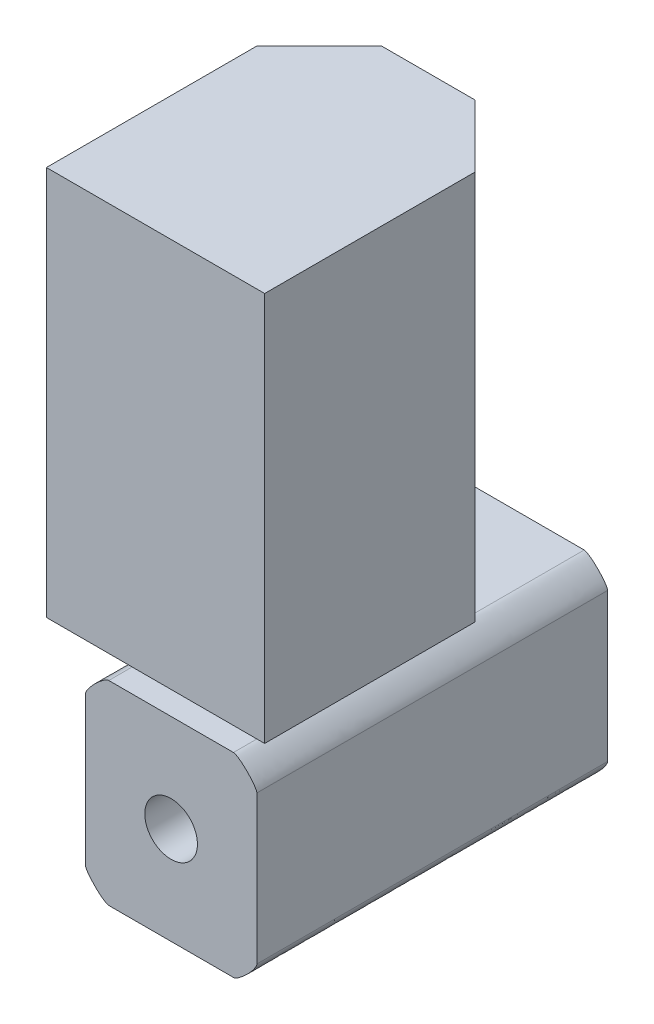
ISO-10303-21;
HEADER;
FILE_DESCRIPTION(('STEP AP214'),'2;1');
FILE_NAME('part.step','',(''),(''),'','','');
FILE_SCHEMA(('AUTOMOTIVE_DESIGN { 1 0 10303 214 1 1 1 1 }'));
ENDSEC;
DATA;
#1=APPLICATION_CONTEXT('core data for automotive mechanical design processes');
#2=APPLICATION_PROTOCOL_DEFINITION('international standard','automotive_design',2000,#1);
#3=PRODUCT_CONTEXT('',#1,'mechanical');
#4=PRODUCT('Part','Part','',(#3));
#5=PRODUCT_RELATED_PRODUCT_CATEGORY('part','',(#4));
#6=PRODUCT_DEFINITION_FORMATION('','',#4);
#7=PRODUCT_DEFINITION_CONTEXT('part definition',#1,'design');
#8=PRODUCT_DEFINITION('design','',#6,#7);
#9=PRODUCT_DEFINITION_SHAPE('','',#8);
#10=(LENGTH_UNIT() NAMED_UNIT(*) SI_UNIT(.MILLI.,.METRE.));
#11=(NAMED_UNIT(*) PLANE_ANGLE_UNIT() SI_UNIT($,.RADIAN.));
#12=(NAMED_UNIT(*) SI_UNIT($,.STERADIAN.) SOLID_ANGLE_UNIT());
#13=UNCERTAINTY_MEASURE_WITH_UNIT(LENGTH_MEASURE(1.E-05),#10,'distance_accuracy_value','');
#14=(GEOMETRIC_REPRESENTATION_CONTEXT(3) GLOBAL_UNCERTAINTY_ASSIGNED_CONTEXT((#13)) GLOBAL_UNIT_ASSIGNED_CONTEXT((#10,
#11,#12)) REPRESENTATION_CONTEXT('',''));
#15=CARTESIAN_POINT('',(0.,0.,0.));
#16=DIRECTION('',(0.,0.,1.));
#17=DIRECTION('',(1.,0.,0.));
#18=AXIS2_PLACEMENT_3D('',#15,#16,#17);
#19=CARTESIAN_POINT('',(-88.8214874697385,29.1570616468552,45.));
#20=DIRECTION('',(0.,1.,0.));
#21=DIRECTION('',(0.,0.,1.));
#22=AXIS2_PLACEMENT_3D('',#19,#20,#21);
#23=PLANE('',#22);
#24=DIRECTION('',(-0.866025403784439,0.,0.5));
#25=VECTOR('',#24,1.);
#26=CARTESIAN_POINT('',(-77.8214874697385,29.1570616468552,13.8397459621556));
#27=LINE('',#26,#25);
#28=CARTESIAN_POINT('',(-77.8214874697385,29.1570616468552,13.8397459621556));
#29=VERTEX_POINT('',#28);
#30=CARTESIAN_POINT('',(-85.3214874697385,29.1570616468552,18.1698729810778));
#31=VERTEX_POINT('',#30);
#32=EDGE_CURVE('E206',#29,#31,#27,.T.);
#33=ORIENTED_EDGE('',*,*,#32,.F.);
#34=DIRECTION('',(-0.866025403784439,0.,-0.5));
#35=VECTOR('',#34,1.);
#36=CARTESIAN_POINT('',(-70.3214874697385,29.1570616468552,18.1698729810778));
#37=LINE('',#36,#35);
#38=CARTESIAN_POINT('',(-70.3214874697385,29.1570616468552,18.1698729810778));
#39=VERTEX_POINT('',#38);
#40=EDGE_CURVE('E276',#39,#29,#37,.T.);
#41=ORIENTED_EDGE('',*,*,#40,.F.);
#42=DIRECTION('',(0.,0.,-1.));
#43=VECTOR('',#42,1.);
#44=CARTESIAN_POINT('',(-70.3214874697385,29.1570616468552,26.8301270189222));
#45=LINE('',#44,#43);
#46=CARTESIAN_POINT('',(-70.3214874697385,29.1570616468552,26.8301270189222));
#47=VERTEX_POINT('',#46);
#48=EDGE_CURVE('E312',#47,#39,#45,.T.);
#49=ORIENTED_EDGE('',*,*,#48,.F.);
#50=DIRECTION('',(0.866025403784438,0.,-0.5));
#51=VECTOR('',#50,1.);
#52=CARTESIAN_POINT('',(-77.8214874697385,29.1570616468552,31.1602540378444));
#53=LINE('',#52,#51);
#54=CARTESIAN_POINT('',(-77.8214874697385,29.1570616468552,31.1602540378444));
#55=VERTEX_POINT('',#54);
#56=EDGE_CURVE('E308',#55,#47,#53,.T.);
#57=ORIENTED_EDGE('',*,*,#56,.F.);
#58=DIRECTION('',(0.866025403784439,0.,0.5));
#59=VECTOR('',#58,1.);
#60=CARTESIAN_POINT('',(-85.3214874697385,29.1570616468552,26.8301270189222));
#61=LINE('',#60,#59);
#62=CARTESIAN_POINT('',(-85.3214874697385,29.1570616468552,26.8301270189222));
#63=VERTEX_POINT('',#62);
#64=EDGE_CURVE('E304',#63,#55,#61,.T.);
#65=ORIENTED_EDGE('',*,*,#64,.F.);
#66=DIRECTION('',(0.,0.,1.));
#67=VECTOR('',#66,1.);
#68=CARTESIAN_POINT('',(-85.3214874697385,29.1570616468552,18.1698729810778));
#69=LINE('',#68,#67);
#70=EDGE_CURVE('E300',#31,#63,#69,.T.);
#71=ORIENTED_EDGE('',*,*,#70,.F.);
#72=EDGE_LOOP('',(#33,#41,#49,#57,#65,#71));
#73=FACE_BOUND('',#72,.T.);
#74=DIRECTION('',(1.,0.,0.));
#75=VECTOR('',#74,1.);
#76=CARTESIAN_POINT('',(-88.8214874697385,29.1570616468552,0.));
#77=LINE('',#76,#75);
#78=CARTESIAN_POINT('',(-85.8214874697385,29.1570616468552,0.));
#79=VERTEX_POINT('',#78);
#80=CARTESIAN_POINT('',(-69.8214874697385,29.1570616468552,0.));
#81=VERTEX_POINT('',#80);
#82=EDGE_CURVE('E342',#79,#81,#77,.T.);
#83=ORIENTED_EDGE('',*,*,#82,.F.);
#84=CARTESIAN_POINT('',(-85.8214874697385,29.1570616468552,47.25));
#85=CARTESIAN_POINT('',(-85.8214874697385,29.1570616468552,30.75));
#86=CARTESIAN_POINT('',(-85.8214874697385,29.1570616468552,14.25));
#87=CARTESIAN_POINT('',(-85.8214874697385,29.1570616468552,-2.25));
#88=(BOUNDED_CURVE() B_SPLINE_CURVE(3,(#84,#85,#86,#87),.UNSPECIFIED.,.F.,
.F.) B_SPLINE_CURVE_WITH_KNOTS((4,4),(-0.04725,0.00225),
.UNSPECIFIED.) CURVE() GEOMETRIC_REPRESENTATION_ITEM() RATIONAL_B_SPLINE_CURVE((1.,1.,1.,1.)) REPRESENTATION_ITEM(''));
#89=CARTESIAN_POINT('',(-85.8214874697385,29.1570616468552,45.));
#90=VERTEX_POINT('',#89);
#91=EDGE_CURVE('E564',#79,#90,#88,.F.);
#92=ORIENTED_EDGE('',*,*,#91,.T.);
#93=DIRECTION('',(1.,0.,0.));
#94=VECTOR('',#93,1.);
#95=CARTESIAN_POINT('',(-88.8214874697385,29.1570616468552,45.));
#96=LINE('',#95,#94);
#97=CARTESIAN_POINT('',(-69.8214874697385,29.1570616468552,45.));
#98=VERTEX_POINT('',#97);
#99=EDGE_CURVE('E348',#90,#98,#96,.T.);
#100=ORIENTED_EDGE('',*,*,#99,.T.);
#101=CARTESIAN_POINT('',(-69.8214874697385,29.1570616468552,-2.25));
#102=CARTESIAN_POINT('',(-69.8214874697385,29.1570616468552,14.25));
#103=CARTESIAN_POINT('',(-69.8214874697385,29.1570616468552,30.75));
#104=CARTESIAN_POINT('',(-69.8214874697385,29.1570616468552,47.25));
#105=(BOUNDED_CURVE() B_SPLINE_CURVE(3,(#101,#102,#103,#104),.UNSPECIFIED.,.F.,
.F.) B_SPLINE_CURVE_WITH_KNOTS((4,4),(-0.00225,0.04725),
.UNSPECIFIED.) CURVE() GEOMETRIC_REPRESENTATION_ITEM() RATIONAL_B_SPLINE_CURVE((1.,1.,1.,1.)) REPRESENTATION_ITEM(''));
#106=EDGE_CURVE('E416',#98,#81,#105,.F.);
#107=ORIENTED_EDGE('',*,*,#106,.T.);
#108=EDGE_LOOP('',(#83,#92,#100,#107));
#109=FACE_BOUND('',#108,.T.);
#110=ADVANCED_FACE('F48',(#73,#109),#23,.T.);
#111=CARTESIAN_POINT('',(-88.8214874697385,29.1570616468552,45.));
#112=DIRECTION('',(1.,0.,0.));
#113=DIRECTION('',(0.,0.,-1.));
#114=AXIS2_PLACEMENT_3D('',#111,#112,#113);
#115=PLANE('',#114);
#116=DIRECTION('',(0.,-1.,0.));
#117=VECTOR('',#116,1.);
#118=CARTESIAN_POINT('',(-88.8214874697385,29.1570616468552,0.));
#119=LINE('',#118,#117);
#120=CARTESIAN_POINT('',(-88.8214874697385,26.1570616468552,0.));
#121=VERTEX_POINT('',#120);
#122=CARTESIAN_POINT('',(-88.8214874697385,7.15706164685515,0.));
#123=VERTEX_POINT('',#122);
#124=EDGE_CURVE('E354',#121,#123,#119,.T.);
#125=ORIENTED_EDGE('',*,*,#124,.T.);
#126=CARTESIAN_POINT('',(-88.8214874697385,7.15706164685515,47.25));
#127=CARTESIAN_POINT('',(-88.8214874697385,7.15706164685515,30.75));
#128=CARTESIAN_POINT('',(-88.8214874697385,7.15706164685515,14.25));
#129=CARTESIAN_POINT('',(-88.8214874697385,7.15706164685515,-2.25));
#130=(BOUNDED_CURVE() B_SPLINE_CURVE(3,(#126,#127,#128,#129),.UNSPECIFIED.,.F.,
.F.) B_SPLINE_CURVE_WITH_KNOTS((4,4),(-0.00225,0.04725),
.UNSPECIFIED.) CURVE() GEOMETRIC_REPRESENTATION_ITEM() RATIONAL_B_SPLINE_CURVE((1.,1.,1.,1.)) REPRESENTATION_ITEM(''));
#131=CARTESIAN_POINT('',(-88.8214874697385,7.15706164685515,45.));
#132=VERTEX_POINT('',#131);
#133=EDGE_CURVE('E505',#123,#132,#130,.F.);
#134=ORIENTED_EDGE('',*,*,#133,.T.);
#135=DIRECTION('',(0.,-1.,0.));
#136=VECTOR('',#135,1.);
#137=CARTESIAN_POINT('',(-88.8214874697385,29.1570616468552,45.));
#138=LINE('',#137,#136);
#139=CARTESIAN_POINT('',(-88.8214874697385,26.1570616468552,45.));
#140=VERTEX_POINT('',#139);
#141=EDGE_CURVE('E647',#140,#132,#138,.T.);
#142=ORIENTED_EDGE('',*,*,#141,.F.);
#143=CARTESIAN_POINT('',(-88.8214874697385,26.1570616468552,-2.25));
#144=CARTESIAN_POINT('',(-88.8214874697385,26.1570616468552,14.25));
#145=CARTESIAN_POINT('',(-88.8214874697385,26.1570616468552,30.75));
#146=CARTESIAN_POINT('',(-88.8214874697385,26.1570616468552,47.25));
#147=(BOUNDED_CURVE() B_SPLINE_CURVE(3,(#143,#144,#145,#146),.UNSPECIFIED.,.F.,
.F.) B_SPLINE_CURVE_WITH_KNOTS((4,4),(-0.04725,0.00225),
.UNSPECIFIED.) CURVE() GEOMETRIC_REPRESENTATION_ITEM() RATIONAL_B_SPLINE_CURVE((1.,1.,1.,1.)) REPRESENTATION_ITEM(''));
#148=EDGE_CURVE('E713',#140,#121,#147,.F.);
#149=ORIENTED_EDGE('',*,*,#148,.T.);
#150=EDGE_LOOP('',(#125,#134,#142,#149));
#151=FACE_BOUND('',#150,.T.);
#152=ADVANCED_FACE('F432',(#151),#115,.F.);
#153=CARTESIAN_POINT('',(-88.8214874697385,4.15706164685515,45.));
#154=DIRECTION('',(0.,1.,0.));
#155=DIRECTION('',(-1.,0.,0.));
#156=AXIS2_PLACEMENT_3D('',#153,#154,#155);
#157=PLANE('',#156);
#158=DIRECTION('',(1.,0.,0.));
#159=VECTOR('',#158,1.);
#160=CARTESIAN_POINT('',(-88.8214874697385,4.15706164685515,45.));
#161=LINE('',#160,#159);
#162=CARTESIAN_POINT('',(-85.8214874697385,4.15706164685515,45.));
#163=VERTEX_POINT('',#162);
#164=CARTESIAN_POINT('',(-69.8214874697385,4.15706164685515,45.));
#165=VERTEX_POINT('',#164);
#166=EDGE_CURVE('E360',#163,#165,#161,.T.);
#167=ORIENTED_EDGE('',*,*,#166,.F.);
#168=CARTESIAN_POINT('',(-85.8214874697385,4.15706164685515,-2.25));
#169=CARTESIAN_POINT('',(-85.8214874697385,4.15706164685515,14.25));
#170=CARTESIAN_POINT('',(-85.8214874697385,4.15706164685515,30.75));
#171=CARTESIAN_POINT('',(-85.8214874697385,4.15706164685515,47.25));
#172=(BOUNDED_CURVE() B_SPLINE_CURVE(3,(#168,#169,#170,#171),.UNSPECIFIED.,.F.,
.F.) B_SPLINE_CURVE_WITH_KNOTS((4,4),(-0.00225,0.04725),
.UNSPECIFIED.) CURVE() GEOMETRIC_REPRESENTATION_ITEM() RATIONAL_B_SPLINE_CURVE((1.,1.,1.,1.)) REPRESENTATION_ITEM(''));
#173=CARTESIAN_POINT('',(-85.8214874697385,4.15706164685515,0.));
#174=VERTEX_POINT('',#173);
#175=EDGE_CURVE('E486',#163,#174,#172,.F.);
#176=ORIENTED_EDGE('',*,*,#175,.T.);
#177=DIRECTION('',(1.,0.,0.));
#178=VECTOR('',#177,1.);
#179=CARTESIAN_POINT('',(-88.8214874697385,4.15706164685515,0.));
#180=LINE('',#179,#178);
#181=CARTESIAN_POINT('',(-69.8214874697385,4.15706164685515,0.));
#182=VERTEX_POINT('',#181);
#183=EDGE_CURVE('E678',#174,#182,#180,.T.);
#184=ORIENTED_EDGE('',*,*,#183,.T.);
#185=CARTESIAN_POINT('',(-69.8214874697385,4.15706164685515,47.25));
#186=CARTESIAN_POINT('',(-69.8214874697385,4.15706164685515,30.75));
#187=CARTESIAN_POINT('',(-69.8214874697385,4.15706164685515,14.25));
#188=CARTESIAN_POINT('',(-69.8214874697385,4.15706164685515,-2.25));
#189=(BOUNDED_CURVE() B_SPLINE_CURVE(3,(#185,#186,#187,#188),.UNSPECIFIED.,.F.,
.F.) B_SPLINE_CURVE_WITH_KNOTS((4,4),(-0.04725,0.00225),
.UNSPECIFIED.) CURVE() GEOMETRIC_REPRESENTATION_ITEM() RATIONAL_B_SPLINE_CURVE((1.,1.,1.,1.)) REPRESENTATION_ITEM(''));
#190=EDGE_CURVE('E642',#182,#165,#189,.F.);
#191=ORIENTED_EDGE('',*,*,#190,.T.);
#192=EDGE_LOOP('',(#167,#176,#184,#191));
#193=FACE_BOUND('',#192,.T.);
#194=ADVANCED_FACE('F691',(#193),#157,.F.);
#195=CARTESIAN_POINT('',(-66.8214874697385,29.1570616468552,45.));
#196=DIRECTION('',(1.,0.,0.));
#197=DIRECTION('',(0.,0.,-1.));
#198=AXIS2_PLACEMENT_3D('',#195,#196,#197);
#199=PLANE('',#198);
#200=DIRECTION('',(0.,-1.,0.));
#201=VECTOR('',#200,1.);
#202=CARTESIAN_POINT('',(-66.8214874697385,29.1570616468552,0.));
#203=LINE('',#202,#201);
#204=CARTESIAN_POINT('',(-66.8214874697385,26.1570616468552,0.));
#205=VERTEX_POINT('',#204);
#206=CARTESIAN_POINT('',(-66.8214874697385,7.15706164685515,0.));
#207=VERTEX_POINT('',#206);
#208=EDGE_CURVE('E672',#205,#207,#203,.T.);
#209=ORIENTED_EDGE('',*,*,#208,.F.);
#210=CARTESIAN_POINT('',(-66.8214874697385,26.1570616468552,47.25));
#211=CARTESIAN_POINT('',(-66.8214874697385,26.1570616468552,30.75));
#212=CARTESIAN_POINT('',(-66.8214874697385,26.1570616468552,14.25));
#213=CARTESIAN_POINT('',(-66.8214874697385,26.1570616468552,-2.25));
#214=(BOUNDED_CURVE() B_SPLINE_CURVE(3,(#210,#211,#212,#213),.UNSPECIFIED.,.F.,
.F.) B_SPLINE_CURVE_WITH_KNOTS((4,4),(-0.00225,0.04725),
.UNSPECIFIED.) CURVE() GEOMETRIC_REPRESENTATION_ITEM() RATIONAL_B_SPLINE_CURVE((1.,1.,1.,1.)) REPRESENTATION_ITEM(''));
#215=CARTESIAN_POINT('',(-66.8214874697385,26.1570616468552,45.));
#216=VERTEX_POINT('',#215);
#217=EDGE_CURVE('E12',#205,#216,#214,.F.);
#218=ORIENTED_EDGE('',*,*,#217,.T.);
#219=DIRECTION('',(0.,-1.,0.));
#220=VECTOR('',#219,1.);
#221=CARTESIAN_POINT('',(-66.8214874697385,29.1570616468552,45.));
#222=LINE('',#221,#220);
#223=CARTESIAN_POINT('',(-66.8214874697385,7.15706164685515,45.));
#224=VERTEX_POINT('',#223);
#225=EDGE_CURVE('E353',#216,#224,#222,.T.);
#226=ORIENTED_EDGE('',*,*,#225,.T.);
#227=CARTESIAN_POINT('',(-66.8214874697385,7.15706164685515,-2.25));
#228=CARTESIAN_POINT('',(-66.8214874697385,7.15706164685515,14.25));
#229=CARTESIAN_POINT('',(-66.8214874697385,7.15706164685515,30.75));
#230=CARTESIAN_POINT('',(-66.8214874697385,7.15706164685515,47.25));
#231=(BOUNDED_CURVE() B_SPLINE_CURVE(3,(#227,#228,#229,#230),.UNSPECIFIED.,.F.,
.F.) B_SPLINE_CURVE_WITH_KNOTS((4,4),(-0.04725,0.00225),
.UNSPECIFIED.) CURVE() GEOMETRIC_REPRESENTATION_ITEM() RATIONAL_B_SPLINE_CURVE((1.,1.,1.,1.)) REPRESENTATION_ITEM(''));
#232=EDGE_CURVE('E63',#224,#207,#231,.F.);
#233=ORIENTED_EDGE('',*,*,#232,.T.);
#234=EDGE_LOOP('',(#209,#218,#226,#233));
#235=FACE_BOUND('',#234,.T.);
#236=ADVANCED_FACE('F378',(#235),#199,.T.);
#237=CARTESIAN_POINT('',(0.,0.,45.));
#238=DIRECTION('',(0.,0.,-1.));
#239=DIRECTION('',(-1.,0.,0.));
#240=AXIS2_PLACEMENT_3D('',#237,#238,#239);
#241=PLANE('',#240);
#242=CARTESIAN_POINT('',(-77.8214874697385,16.6570616468552,45.));
#243=DIRECTION('',(0.,0.,-1.));
#244=DIRECTION('',(-1.,0.,0.));
#245=AXIS2_PLACEMENT_3D('',#242,#243,#244);
#246=CIRCLE('',#245,3.37819999999998);
#247=CARTESIAN_POINT('',(-81.1996874697385,16.6570616468552,45.));
#248=VERTEX_POINT('',#247);
#249=EDGE_CURVE('E240',#248,#248,#246,.T.);
#250=ORIENTED_EDGE('',*,*,#249,.T.);
#251=EDGE_LOOP('',(#250));
#252=FACE_BOUND('',#251,.T.);
#253=ORIENTED_EDGE('',*,*,#141,.T.);
#254=CARTESIAN_POINT('',(-85.8214874697385,4.15706164685515,45.));
#255=CARTESIAN_POINT('',(-88.8214874697385,4.15706164685516,45.));
#256=CARTESIAN_POINT('',(-88.8214874697385,7.15706164685515,45.));
#257=(BOUNDED_CURVE() B_SPLINE_CURVE(2,(#254,#255,#256),.UNSPECIFIED.,.F.,
.F.) B_SPLINE_CURVE_WITH_KNOTS((3,3),(0.,1.),
.UNSPECIFIED.) CURVE() GEOMETRIC_REPRESENTATION_ITEM() RATIONAL_B_SPLINE_CURVE((1.,
0.212132034355965,1.)) REPRESENTATION_ITEM(''));
#258=EDGE_CURVE('E401',#132,#163,#257,.F.);
#259=ORIENTED_EDGE('',*,*,#258,.T.);
#260=ORIENTED_EDGE('',*,*,#166,.T.);
#261=CARTESIAN_POINT('',(-66.8214874697385,7.15706164685515,45.));
#262=CARTESIAN_POINT('',(-66.8214874697385,4.15706164685515,45.));
#263=CARTESIAN_POINT('',(-69.8214874697385,4.15706164685515,45.));
#264=(BOUNDED_CURVE() B_SPLINE_CURVE(2,(#261,#262,#263),.UNSPECIFIED.,.F.,
.F.) B_SPLINE_CURVE_WITH_KNOTS((3,3),(0.,1.),
.UNSPECIFIED.) CURVE() GEOMETRIC_REPRESENTATION_ITEM() RATIONAL_B_SPLINE_CURVE((1.,
0.212132034355964,1.)) REPRESENTATION_ITEM(''));
#265=EDGE_CURVE('E70',#165,#224,#264,.F.);
#266=ORIENTED_EDGE('',*,*,#265,.T.);
#267=ORIENTED_EDGE('',*,*,#225,.F.);
#268=CARTESIAN_POINT('',(-69.8214874697385,29.1570616468552,45.));
#269=CARTESIAN_POINT('',(-66.8214874697385,29.1570616468552,45.));
#270=CARTESIAN_POINT('',(-66.8214874697385,26.1570616468552,45.));
#271=(BOUNDED_CURVE() B_SPLINE_CURVE(2,(#268,#269,#270),.UNSPECIFIED.,.F.,
.F.) B_SPLINE_CURVE_WITH_KNOTS((3,3),(0.,1.),
.UNSPECIFIED.) CURVE() GEOMETRIC_REPRESENTATION_ITEM() RATIONAL_B_SPLINE_CURVE((1.,
0.212132034355964,1.)) REPRESENTATION_ITEM(''));
#272=EDGE_CURVE('E595',#216,#98,#271,.F.);
#273=ORIENTED_EDGE('',*,*,#272,.T.);
#274=ORIENTED_EDGE('',*,*,#99,.F.);
#275=CARTESIAN_POINT('',(-88.8214874697385,26.1570616468552,45.));
#276=CARTESIAN_POINT('',(-88.8214874697385,29.1570616468551,45.));
#277=CARTESIAN_POINT('',(-85.8214874697385,29.1570616468552,45.));
#278=(BOUNDED_CURVE() B_SPLINE_CURVE(2,(#275,#276,#277),.UNSPECIFIED.,.F.,
.F.) B_SPLINE_CURVE_WITH_KNOTS((3,3),(0.,1.),
.UNSPECIFIED.) CURVE() GEOMETRIC_REPRESENTATION_ITEM() RATIONAL_B_SPLINE_CURVE((1.,
0.212132034355965,1.)) REPRESENTATION_ITEM(''));
#279=EDGE_CURVE('E976',#90,#140,#278,.F.);
#280=ORIENTED_EDGE('',*,*,#279,.T.);
#281=EDGE_LOOP('',(#253,#259,#260,#266,#267,#273,#274,#280));
#282=FACE_BOUND('',#281,.T.);
#283=ADVANCED_FACE('F367',(#252,#282),#241,.F.);
#284=CARTESIAN_POINT('',(0.,0.,0.));
#285=DIRECTION('',(0.,0.,-1.));
#286=DIRECTION('',(-1.,0.,0.));
#287=AXIS2_PLACEMENT_3D('',#284,#285,#286);
#288=PLANE('',#287);
#289=CARTESIAN_POINT('',(-77.8214874697385,16.6570616468552,0.));
#290=DIRECTION('',(0.,0.,-1.));
#291=DIRECTION('',(-1.,0.,0.));
#292=AXIS2_PLACEMENT_3D('',#289,#290,#291);
#293=CIRCLE('',#292,4.01319999999999);
#294=CARTESIAN_POINT('',(-81.8346874697385,16.6570616468552,0.));
#295=VERTEX_POINT('',#294);
#296=EDGE_CURVE('E950',#295,#295,#293,.T.);
#297=ORIENTED_EDGE('',*,*,#296,.F.);
#298=EDGE_LOOP('',(#297));
#299=FACE_BOUND('',#298,.T.);
#300=ORIENTED_EDGE('',*,*,#183,.F.);
#301=CARTESIAN_POINT('',(-88.8214874697385,7.15706164685515,0.));
#302=CARTESIAN_POINT('',(-88.8214874697385,4.15706164685516,0.));
#303=CARTESIAN_POINT('',(-85.8214874697385,4.15706164685515,0.));
#304=(BOUNDED_CURVE() B_SPLINE_CURVE(2,(#301,#302,#303),.UNSPECIFIED.,.F.,
.F.) B_SPLINE_CURVE_WITH_KNOTS((3,3),(0.,1.),
.UNSPECIFIED.) CURVE() GEOMETRIC_REPRESENTATION_ITEM() RATIONAL_B_SPLINE_CURVE((1.,
0.212132034355965,1.)) REPRESENTATION_ITEM(''));
#305=EDGE_CURVE('E475',#174,#123,#304,.F.);
#306=ORIENTED_EDGE('',*,*,#305,.T.);
#307=ORIENTED_EDGE('',*,*,#124,.F.);
#308=CARTESIAN_POINT('',(-85.8214874697385,29.1570616468552,0.));
#309=CARTESIAN_POINT('',(-88.8214874697385,29.1570616468551,0.));
#310=CARTESIAN_POINT('',(-88.8214874697385,26.1570616468552,0.));
#311=(BOUNDED_CURVE() B_SPLINE_CURVE(2,(#308,#309,#310),.UNSPECIFIED.,.F.,
.F.) B_SPLINE_CURVE_WITH_KNOTS((3,3),(0.,1.),
.UNSPECIFIED.) CURVE() GEOMETRIC_REPRESENTATION_ITEM() RATIONAL_B_SPLINE_CURVE((1.,
0.212132034355965,1.)) REPRESENTATION_ITEM(''));
#312=EDGE_CURVE('E518',#121,#79,#311,.F.);
#313=ORIENTED_EDGE('',*,*,#312,.T.);
#314=ORIENTED_EDGE('',*,*,#82,.T.);
#315=CARTESIAN_POINT('',(-66.8214874697385,26.1570616468552,0.));
#316=CARTESIAN_POINT('',(-66.8214874697385,29.1570616468552,0.));
#317=CARTESIAN_POINT('',(-69.8214874697385,29.1570616468552,0.));
#318=(BOUNDED_CURVE() B_SPLINE_CURVE(2,(#315,#316,#317),.UNSPECIFIED.,.F.,
.F.) B_SPLINE_CURVE_WITH_KNOTS((3,3),(0.,1.),
.UNSPECIFIED.) CURVE() GEOMETRIC_REPRESENTATION_ITEM() RATIONAL_B_SPLINE_CURVE((1.,
0.212132034355964,1.)) REPRESENTATION_ITEM(''));
#319=EDGE_CURVE('E575',#81,#205,#318,.F.);
#320=ORIENTED_EDGE('',*,*,#319,.T.);
#321=ORIENTED_EDGE('',*,*,#208,.T.);
#322=CARTESIAN_POINT('',(-69.8214874697385,4.15706164685515,0.));
#323=CARTESIAN_POINT('',(-66.8214874697385,4.15706164685515,0.));
#324=CARTESIAN_POINT('',(-66.8214874697385,7.15706164685515,0.));
#325=(BOUNDED_CURVE() B_SPLINE_CURVE(2,(#322,#323,#324),.UNSPECIFIED.,.F.,
.F.) B_SPLINE_CURVE_WITH_KNOTS((3,3),(0.,1.),
.UNSPECIFIED.) CURVE() GEOMETRIC_REPRESENTATION_ITEM() RATIONAL_B_SPLINE_CURVE((1.,
0.212132034355964,1.)) REPRESENTATION_ITEM(''));
#326=EDGE_CURVE('E616',#207,#182,#325,.F.);
#327=ORIENTED_EDGE('',*,*,#326,.T.);
#328=EDGE_LOOP('',(#300,#306,#307,#313,#314,#320,#321,#327));
#329=FACE_BOUND('',#328,.T.);
#330=ADVANCED_FACE('F377',(#299,#329),#288,.T.);
#331=CARTESIAN_POINT('',(-77.8214874697385,34.1570616468551,13.8397459621556));
#332=DIRECTION('',(0.5,0.,0.866025403784439));
#333=DIRECTION('',(0.866025403784439,0.,-0.5));
#334=AXIS2_PLACEMENT_3D('',#331,#332,#333);
#335=PLANE('',#334);
#336=ORIENTED_EDGE('',*,*,#32,.T.);
#337=DIRECTION('',(0.,-1.,0.));
#338=VECTOR('',#337,1.);
#339=CARTESIAN_POINT('',(-85.3214874697385,34.1570616468551,18.1698729810778));
#340=LINE('',#339,#338);
#341=CARTESIAN_POINT('',(-85.3214874697385,34.1570616468551,18.1698729810778));
#342=VERTEX_POINT('',#341);
#343=EDGE_CURVE('E338',#342,#31,#340,.T.);
#344=ORIENTED_EDGE('',*,*,#343,.F.);
#345=DIRECTION('',(-0.866025403784439,0.,0.5));
#346=VECTOR('',#345,1.);
#347=CARTESIAN_POINT('',(-77.8214874697385,34.1570616468551,13.8397459621556));
#348=LINE('',#347,#346);
#349=CARTESIAN_POINT('',(-77.8214874697385,34.1570616468551,13.8397459621556));
#350=VERTEX_POINT('',#349);
#351=EDGE_CURVE('E271',#350,#342,#348,.T.);
#352=ORIENTED_EDGE('',*,*,#351,.F.);
#353=DIRECTION('',(0.,-1.,0.));
#354=VECTOR('',#353,1.);
#355=CARTESIAN_POINT('',(-77.8214874697385,34.1570616468551,13.8397459621556));
#356=LINE('',#355,#354);
#357=EDGE_CURVE('E296',#350,#29,#356,.T.);
#358=ORIENTED_EDGE('',*,*,#357,.T.);
#359=EDGE_LOOP('',(#336,#344,#352,#358));
#360=FACE_BOUND('',#359,.T.);
#361=ADVANCED_FACE('F380',(#360),#335,.F.);
#362=CARTESIAN_POINT('',(-85.3214874697385,34.1570616468551,18.1698729810778));
#363=DIRECTION('',(1.,0.,0.));
#364=DIRECTION('',(0.,0.,-1.));
#365=AXIS2_PLACEMENT_3D('',#362,#363,#364);
#366=PLANE('',#365);
#367=ORIENTED_EDGE('',*,*,#70,.T.);
#368=DIRECTION('',(0.,-1.,0.));
#369=VECTOR('',#368,1.);
#370=CARTESIAN_POINT('',(-85.3214874697385,34.1570616468551,26.8301270189222));
#371=LINE('',#370,#369);
#372=CARTESIAN_POINT('',(-85.3214874697385,34.1570616468551,26.8301270189222));
#373=VERTEX_POINT('',#372);
#374=EDGE_CURVE('E334',#373,#63,#371,.T.);
#375=ORIENTED_EDGE('',*,*,#374,.F.);
#376=DIRECTION('',(0.,0.,1.));
#377=VECTOR('',#376,1.);
#378=CARTESIAN_POINT('',(-85.3214874697385,34.1570616468551,18.1698729810778));
#379=LINE('',#378,#377);
#380=EDGE_CURVE('E275',#342,#373,#379,.T.);
#381=ORIENTED_EDGE('',*,*,#380,.F.);
#382=ORIENTED_EDGE('',*,*,#343,.T.);
#383=EDGE_LOOP('',(#367,#375,#381,#382));
#384=FACE_BOUND('',#383,.T.);
#385=ADVANCED_FACE('F746',(#384),#366,.F.);
#386=CARTESIAN_POINT('',(-85.3214874697385,34.1570616468551,26.8301270189222));
#387=DIRECTION('',(0.5,0.,-0.866025403784439));
#388=DIRECTION('',(-0.866025403784439,0.,-0.5));
#389=AXIS2_PLACEMENT_3D('',#386,#387,#388);
#390=PLANE('',#389);
#391=ORIENTED_EDGE('',*,*,#64,.T.);
#392=DIRECTION('',(0.,-1.,0.));
#393=VECTOR('',#392,1.);
#394=CARTESIAN_POINT('',(-77.8214874697385,34.1570616468551,31.1602540378444));
#395=LINE('',#394,#393);
#396=CARTESIAN_POINT('',(-77.8214874697385,34.1570616468551,31.1602540378444));
#397=VERTEX_POINT('',#396);
#398=EDGE_CURVE('E330',#397,#55,#395,.T.);
#399=ORIENTED_EDGE('',*,*,#398,.F.);
#400=DIRECTION('',(0.866025403784439,0.,0.5));
#401=VECTOR('',#400,1.);
#402=CARTESIAN_POINT('',(-85.3214874697385,34.1570616468551,26.8301270189222));
#403=LINE('',#402,#401);
#404=EDGE_CURVE('E280',#373,#397,#403,.T.);
#405=ORIENTED_EDGE('',*,*,#404,.F.);
#406=ORIENTED_EDGE('',*,*,#374,.T.);
#407=EDGE_LOOP('',(#391,#399,#405,#406));
#408=FACE_BOUND('',#407,.T.);
#409=ADVANCED_FACE('F753',(#408),#390,.F.);
#410=CARTESIAN_POINT('',(-77.8214874697385,34.1570616468551,31.1602540378444));
#411=DIRECTION('',(-0.5,0.,-0.866025403784439));
#412=DIRECTION('',(-0.866025403784439,0.,0.5));
#413=AXIS2_PLACEMENT_3D('',#410,#411,#412);
#414=PLANE('',#413);
#415=ORIENTED_EDGE('',*,*,#56,.T.);
#416=DIRECTION('',(0.,-1.,0.));
#417=VECTOR('',#416,1.);
#418=CARTESIAN_POINT('',(-70.3214874697385,34.1570616468551,26.8301270189222));
#419=LINE('',#418,#417);
#420=CARTESIAN_POINT('',(-70.3214874697385,34.1570616468551,26.8301270189222));
#421=VERTEX_POINT('',#420);
#422=EDGE_CURVE('E326',#421,#47,#419,.T.);
#423=ORIENTED_EDGE('',*,*,#422,.F.);
#424=DIRECTION('',(0.866025403784438,0.,-0.5));
#425=VECTOR('',#424,1.);
#426=CARTESIAN_POINT('',(-77.8214874697385,34.1570616468551,31.1602540378444));
#427=LINE('',#426,#425);
#428=EDGE_CURVE('E284',#397,#421,#427,.T.);
#429=ORIENTED_EDGE('',*,*,#428,.F.);
#430=ORIENTED_EDGE('',*,*,#398,.T.);
#431=EDGE_LOOP('',(#415,#423,#429,#430));
#432=FACE_BOUND('',#431,.T.);
#433=ADVANCED_FACE('F760',(#432),#414,.F.);
#434=CARTESIAN_POINT('',(-70.3214874697385,34.1570616468551,26.8301270189222));
#435=DIRECTION('',(-1.,0.,0.));
#436=DIRECTION('',(0.,0.,1.));
#437=AXIS2_PLACEMENT_3D('',#434,#435,#436);
#438=PLANE('',#437);
#439=ORIENTED_EDGE('',*,*,#48,.T.);
#440=DIRECTION('',(0.,-1.,0.));
#441=VECTOR('',#440,1.);
#442=CARTESIAN_POINT('',(-70.3214874697385,34.1570616468551,18.1698729810778));
#443=LINE('',#442,#441);
#444=CARTESIAN_POINT('',(-70.3214874697385,34.1570616468551,18.1698729810778));
#445=VERTEX_POINT('',#444);
#446=EDGE_CURVE('E322',#445,#39,#443,.T.);
#447=ORIENTED_EDGE('',*,*,#446,.F.);
#448=DIRECTION('',(0.,0.,-1.));
#449=VECTOR('',#448,1.);
#450=CARTESIAN_POINT('',(-70.3214874697385,34.1570616468551,26.8301270189222));
#451=LINE('',#450,#449);
#452=EDGE_CURVE('E288',#421,#445,#451,.T.);
#453=ORIENTED_EDGE('',*,*,#452,.F.);
#454=ORIENTED_EDGE('',*,*,#422,.T.);
#455=EDGE_LOOP('',(#439,#447,#453,#454));
#456=FACE_BOUND('',#455,.T.);
#457=ADVANCED_FACE('F768',(#456),#438,.F.);
#458=CARTESIAN_POINT('',(-70.3214874697385,34.1570616468551,18.1698729810778));
#459=DIRECTION('',(-0.5,0.,0.866025403784439));
#460=DIRECTION('',(0.866025403784439,0.,0.5));
#461=AXIS2_PLACEMENT_3D('',#458,#459,#460);
#462=PLANE('',#461);
#463=ORIENTED_EDGE('',*,*,#40,.T.);
#464=ORIENTED_EDGE('',*,*,#357,.F.);
#465=DIRECTION('',(-0.866025403784439,0.,-0.5));
#466=VECTOR('',#465,1.);
#467=CARTESIAN_POINT('',(-70.3214874697385,34.1570616468551,18.1698729810778));
#468=LINE('',#467,#466);
#469=EDGE_CURVE('E292',#445,#350,#468,.T.);
#470=ORIENTED_EDGE('',*,*,#469,.F.);
#471=ORIENTED_EDGE('',*,*,#446,.T.);
#472=EDGE_LOOP('',(#463,#464,#470,#471));
#473=FACE_BOUND('',#472,.T.);
#474=ADVANCED_FACE('F776',(#473),#462,.F.);
#475=CARTESIAN_POINT('',(0.,34.1570616468551,0.));
#476=DIRECTION('',(0.,1.,0.));
#477=DIRECTION('',(0.,0.,1.));
#478=AXIS2_PLACEMENT_3D('',#475,#476,#477);
#479=PLANE('',#478);
#480=DIRECTION('',(0.707106781186548,0.,0.707106781186547));
#481=VECTOR('',#480,1.);
#482=CARTESIAN_POINT('',(-41.9107437348692,34.1570616468551,41.9107437348692));
#483=LINE('',#482,#481);
#484=CARTESIAN_POINT('',(-71.8214874697385,34.1570616468551,12.));
#485=VERTEX_POINT('',#484);
#486=CARTESIAN_POINT('',(-63.8214874697385,34.1570616468551,20.));
#487=VERTEX_POINT('',#486);
#488=EDGE_CURVE('E200',#485,#487,#483,.T.);
#489=ORIENTED_EDGE('',*,*,#488,.T.);
#490=DIRECTION('',(0.,0.,1.));
#491=VECTOR('',#490,1.);
#492=CARTESIAN_POINT('',(-63.8214874697385,34.1570616468551,0.));
#493=LINE('',#492,#491);
#494=CARTESIAN_POINT('',(-63.8214874697385,34.1570616468551,47.));
#495=VERTEX_POINT('',#494);
#496=EDGE_CURVE('E218',#487,#495,#493,.T.);
#497=ORIENTED_EDGE('',*,*,#496,.T.);
#498=DIRECTION('',(1.,0.,0.));
#499=VECTOR('',#498,1.);
#500=CARTESIAN_POINT('',(0.,34.1570616468551,47.));
#501=LINE('',#500,#499);
#502=CARTESIAN_POINT('',(-91.8214874697385,34.1570616468551,47.));
#503=VERTEX_POINT('',#502);
#504=EDGE_CURVE('E250',#503,#495,#501,.T.);
#505=ORIENTED_EDGE('',*,*,#504,.F.);
#506=DIRECTION('',(0.,0.,1.));
#507=VECTOR('',#506,1.);
#508=CARTESIAN_POINT('',(-91.8214874697385,34.1570616468551,0.));
#509=LINE('',#508,#507);
#510=CARTESIAN_POINT('',(-91.8214874697385,34.1570616468551,20.));
#511=VERTEX_POINT('',#510);
#512=EDGE_CURVE('E247',#511,#503,#509,.T.);
#513=ORIENTED_EDGE('',*,*,#512,.F.);
#514=DIRECTION('',(0.707106781186548,0.,-0.707106781186547));
#515=VECTOR('',#514,1.);
#516=CARTESIAN_POINT('',(-35.9107437348692,34.1570616468551,-35.9107437348692));
#517=LINE('',#516,#515);
#518=CARTESIAN_POINT('',(-83.8214874697385,34.1570616468551,12.));
#519=VERTEX_POINT('',#518);
#520=EDGE_CURVE('E243',#511,#519,#517,.T.);
#521=ORIENTED_EDGE('',*,*,#520,.T.);
#522=DIRECTION('',(1.,0.,0.));
#523=VECTOR('',#522,1.);
#524=CARTESIAN_POINT('',(0.,34.1570616468551,12.));
#525=LINE('',#524,#523);
#526=EDGE_CURVE('E239',#519,#485,#525,.T.);
#527=ORIENTED_EDGE('',*,*,#526,.T.);
#528=EDGE_LOOP('',(#489,#497,#505,#513,#521,#527));
#529=FACE_BOUND('',#528,.T.);
#530=ORIENTED_EDGE('',*,*,#469,.T.);
#531=ORIENTED_EDGE('',*,*,#351,.T.);
#532=ORIENTED_EDGE('',*,*,#380,.T.);
#533=ORIENTED_EDGE('',*,*,#404,.T.);
#534=ORIENTED_EDGE('',*,*,#428,.T.);
#535=ORIENTED_EDGE('',*,*,#452,.T.);
#536=EDGE_LOOP('',(#530,#531,#532,#533,#534,#535));
#537=FACE_BOUND('',#536,.T.);
#538=ADVANCED_FACE('F784',(#529,#537),#479,.F.);
#539=CARTESIAN_POINT('',(-41.9107437348692,84.1570616468552,41.9107437348692));
#540=DIRECTION('',(0.707106781186547,0.,-0.707106781186548));
#541=DIRECTION('',(-0.707106781186548,0.,-0.707106781186547));
#542=AXIS2_PLACEMENT_3D('',#539,#540,#541);
#543=PLANE('',#542);
#544=ORIENTED_EDGE('',*,*,#488,.F.);
#545=DIRECTION('',(0.,-1.,0.));
#546=VECTOR('',#545,1.);
#547=CARTESIAN_POINT('',(-71.8214874697385,84.1570616468552,12.));
#548=LINE('',#547,#546);
#549=CARTESIAN_POINT('',(-71.8214874697385,84.1570616468552,12.));
#550=VERTEX_POINT('',#549);
#551=EDGE_CURVE('E194',#550,#485,#548,.T.);
#552=ORIENTED_EDGE('',*,*,#551,.F.);
#553=DIRECTION('',(0.707106781186548,0.,0.707106781186547));
#554=VECTOR('',#553,1.);
#555=CARTESIAN_POINT('',(-41.9107437348692,84.1570616468552,41.9107437348692));
#556=LINE('',#555,#554);
#557=CARTESIAN_POINT('',(-63.8214874697385,84.1570616468552,20.));
#558=VERTEX_POINT('',#557);
#559=EDGE_CURVE('E197',#550,#558,#556,.T.);
#560=ORIENTED_EDGE('',*,*,#559,.T.);
#561=DIRECTION('',(0.,-1.,0.));
#562=VECTOR('',#561,1.);
#563=CARTESIAN_POINT('',(-63.8214874697385,84.1570616468552,20.));
#564=LINE('',#563,#562);
#565=EDGE_CURVE('E236',#558,#487,#564,.T.);
#566=ORIENTED_EDGE('',*,*,#565,.T.);
#567=EDGE_LOOP('',(#544,#552,#560,#566));
#568=FACE_BOUND('',#567,.T.);
#569=ADVANCED_FACE('F196',(#568),#543,.T.);
#570=CARTESIAN_POINT('',(0.,84.1570616468552,12.));
#571=DIRECTION('',(0.,0.,-1.));
#572=DIRECTION('',(-1.,0.,0.));
#573=AXIS2_PLACEMENT_3D('',#570,#571,#572);
#574=PLANE('',#573);
#575=ORIENTED_EDGE('',*,*,#526,.F.);
#576=DIRECTION('',(0.,-1.,0.));
#577=VECTOR('',#576,1.);
#578=CARTESIAN_POINT('',(-83.8214874697385,84.1570616468552,12.));
#579=LINE('',#578,#577);
#580=CARTESIAN_POINT('',(-83.8214874697385,84.1570616468552,12.));
#581=VERTEX_POINT('',#580);
#582=EDGE_CURVE('E207',#581,#519,#579,.T.);
#583=ORIENTED_EDGE('',*,*,#582,.F.);
#584=DIRECTION('',(1.,0.,0.));
#585=VECTOR('',#584,1.);
#586=CARTESIAN_POINT('',(0.,84.1570616468552,12.));
#587=LINE('',#586,#585);
#588=EDGE_CURVE('E213',#581,#550,#587,.T.);
#589=ORIENTED_EDGE('',*,*,#588,.T.);
#590=ORIENTED_EDGE('',*,*,#551,.T.);
#591=EDGE_LOOP('',(#575,#583,#589,#590));
#592=FACE_BOUND('',#591,.T.);
#593=ADVANCED_FACE('F220',(#592),#574,.T.);
#594=CARTESIAN_POINT('',(-35.9107437348692,84.1570616468552,-35.9107437348692));
#595=DIRECTION('',(-0.707106781186547,0.,-0.707106781186548));
#596=DIRECTION('',(-0.707106781186548,0.,0.707106781186547));
#597=AXIS2_PLACEMENT_3D('',#594,#595,#596);
#598=PLANE('',#597);
#599=ORIENTED_EDGE('',*,*,#520,.F.);
#600=DIRECTION('',(0.,-1.,0.));
#601=VECTOR('',#600,1.);
#602=CARTESIAN_POINT('',(-91.8214874697385,84.1570616468552,20.));
#603=LINE('',#602,#601);
#604=CARTESIAN_POINT('',(-91.8214874697385,84.1570616468552,20.));
#605=VERTEX_POINT('',#604);
#606=EDGE_CURVE('E266',#605,#511,#603,.T.);
#607=ORIENTED_EDGE('',*,*,#606,.F.);
#608=DIRECTION('',(0.707106781186548,0.,-0.707106781186547));
#609=VECTOR('',#608,1.);
#610=CARTESIAN_POINT('',(-35.9107437348692,84.1570616468552,-35.9107437348692));
#611=LINE('',#610,#609);
#612=EDGE_CURVE('E222',#605,#581,#611,.T.);
#613=ORIENTED_EDGE('',*,*,#612,.T.);
#614=ORIENTED_EDGE('',*,*,#582,.T.);
#615=EDGE_LOOP('',(#599,#607,#613,#614));
#616=FACE_BOUND('',#615,.T.);
#617=ADVANCED_FACE('F805',(#616),#598,.T.);
#618=CARTESIAN_POINT('',(-91.8214874697385,84.1570616468552,0.));
#619=DIRECTION('',(1.,0.,0.));
#620=DIRECTION('',(0.,0.,-1.));
#621=AXIS2_PLACEMENT_3D('',#618,#619,#620);
#622=PLANE('',#621);
#623=ORIENTED_EDGE('',*,*,#512,.T.);
#624=DIRECTION('',(0.,-1.,0.));
#625=VECTOR('',#624,1.);
#626=CARTESIAN_POINT('',(-91.8214874697385,84.1570616468552,47.));
#627=LINE('',#626,#625);
#628=CARTESIAN_POINT('',(-91.8214874697385,84.1570616468552,47.));
#629=VERTEX_POINT('',#628);
#630=EDGE_CURVE('E262',#629,#503,#627,.T.);
#631=ORIENTED_EDGE('',*,*,#630,.F.);
#632=DIRECTION('',(0.,0.,1.));
#633=VECTOR('',#632,1.);
#634=CARTESIAN_POINT('',(-91.8214874697385,84.1570616468552,0.));
#635=LINE('',#634,#633);
#636=EDGE_CURVE('E225',#605,#629,#635,.T.);
#637=ORIENTED_EDGE('',*,*,#636,.F.);
#638=ORIENTED_EDGE('',*,*,#606,.T.);
#639=EDGE_LOOP('',(#623,#631,#637,#638));
#640=FACE_BOUND('',#639,.T.);
#641=ADVANCED_FACE('F812',(#640),#622,.F.);
#642=CARTESIAN_POINT('',(0.,84.1570616468552,47.));
#643=DIRECTION('',(0.,0.,-1.));
#644=DIRECTION('',(-1.,0.,0.));
#645=AXIS2_PLACEMENT_3D('',#642,#643,#644);
#646=PLANE('',#645);
#647=ORIENTED_EDGE('',*,*,#504,.T.);
#648=DIRECTION('',(0.,-1.,0.));
#649=VECTOR('',#648,1.);
#650=CARTESIAN_POINT('',(-63.8214874697385,84.1570616468552,47.));
#651=LINE('',#650,#649);
#652=CARTESIAN_POINT('',(-63.8214874697385,84.1570616468552,47.));
#653=VERTEX_POINT('',#652);
#654=EDGE_CURVE('E259',#653,#495,#651,.T.);
#655=ORIENTED_EDGE('',*,*,#654,.F.);
#656=DIRECTION('',(1.,0.,0.));
#657=VECTOR('',#656,1.);
#658=CARTESIAN_POINT('',(0.,84.1570616468552,47.));
#659=LINE('',#658,#657);
#660=EDGE_CURVE('E231',#629,#653,#659,.T.);
#661=ORIENTED_EDGE('',*,*,#660,.F.);
#662=ORIENTED_EDGE('',*,*,#630,.T.);
#663=EDGE_LOOP('',(#647,#655,#661,#662));
#664=FACE_BOUND('',#663,.T.);
#665=ADVANCED_FACE('F820',(#664),#646,.F.);
#666=CARTESIAN_POINT('',(-63.8214874697385,84.1570616468552,0.));
#667=DIRECTION('',(1.,0.,0.));
#668=DIRECTION('',(0.,0.,-1.));
#669=AXIS2_PLACEMENT_3D('',#666,#667,#668);
#670=PLANE('',#669);
#671=ORIENTED_EDGE('',*,*,#496,.F.);
#672=ORIENTED_EDGE('',*,*,#565,.F.);
#673=DIRECTION('',(0.,0.,1.));
#674=VECTOR('',#673,1.);
#675=CARTESIAN_POINT('',(-63.8214874697385,84.1570616468552,0.));
#676=LINE('',#675,#674);
#677=EDGE_CURVE('E216',#558,#653,#676,.T.);
#678=ORIENTED_EDGE('',*,*,#677,.T.);
#679=ORIENTED_EDGE('',*,*,#654,.T.);
#680=EDGE_LOOP('',(#671,#672,#678,#679));
#681=FACE_BOUND('',#680,.T.);
#682=ADVANCED_FACE('F828',(#681),#670,.T.);
#683=CARTESIAN_POINT('',(0.,84.1570616468552,0.));
#684=DIRECTION('',(0.,1.,0.));
#685=DIRECTION('',(0.,0.,1.));
#686=AXIS2_PLACEMENT_3D('',#683,#684,#685);
#687=PLANE('',#686);
#688=ORIENTED_EDGE('',*,*,#559,.F.);
#689=ORIENTED_EDGE('',*,*,#588,.F.);
#690=ORIENTED_EDGE('',*,*,#612,.F.);
#691=ORIENTED_EDGE('',*,*,#636,.T.);
#692=ORIENTED_EDGE('',*,*,#660,.T.);
#693=ORIENTED_EDGE('',*,*,#677,.F.);
#694=EDGE_LOOP('',(#688,#689,#690,#691,#692,#693));
#695=FACE_BOUND('',#694,.T.);
#696=ADVANCED_FACE('F211',(#695),#687,.T.);
#697=CARTESIAN_POINT('',(-77.8214874697385,16.6570616468552,0.));
#698=DIRECTION('',(0.,0.,-1.));
#699=DIRECTION('',(-1.,0.,0.));
#700=AXIS2_PLACEMENT_3D('',#697,#698,#699);
#701=CYLINDRICAL_SURFACE('',#700,3.37819999999998);
#702=ORIENTED_EDGE('',*,*,#249,.F.);
#703=EDGE_LOOP('',(#702));
#704=FACE_BOUND('',#703,.T.);
#705=CARTESIAN_POINT('',(-77.8214874697385,16.6570616468552,0.635000000000011));
#706=DIRECTION('',(0.,0.,-1.));
#707=DIRECTION('',(-1.,0.,0.));
#708=AXIS2_PLACEMENT_3D('',#705,#706,#707);
#709=CIRCLE('',#708,3.37819999999998);
#710=CARTESIAN_POINT('',(-81.1996874697385,16.6570616468552,0.635000000000011));
#711=VERTEX_POINT('',#710);
#712=EDGE_CURVE('E947',#711,#711,#709,.T.);
#713=ORIENTED_EDGE('',*,*,#712,.T.);
#714=EDGE_LOOP('',(#713));
#715=FACE_BOUND('',#714,.T.);
#716=ADVANCED_FACE('F843',(#704,#715),#701,.F.);
#717=CARTESIAN_POINT('',(-77.8214874697385,16.6570616468552,0.));
#718=DIRECTION('',(0.,0.,-1.));
#719=DIRECTION('',(-1.,0.,0.));
#720=AXIS2_PLACEMENT_3D('',#717,#718,#719);
#721=CONICAL_SURFACE('',#720,4.01319999999999,0.785398163397447);
#722=ORIENTED_EDGE('',*,*,#712,.F.);
#723=EDGE_LOOP('',(#722));
#724=FACE_BOUND('',#723,.T.);
#725=ORIENTED_EDGE('',*,*,#296,.T.);
#726=EDGE_LOOP('',(#725));
#727=FACE_BOUND('',#726,.T.);
#728=ADVANCED_FACE('F850',(#724,#727),#721,.F.);
#729=CARTESIAN_POINT('',(-85.8214874697385,4.15706164685515,47.25));
#730=CARTESIAN_POINT('',(-85.8214874697385,4.15706164685515,30.75));
#731=CARTESIAN_POINT('',(-85.8214874697385,4.15706164685515,14.25));
#732=CARTESIAN_POINT('',(-85.8214874697385,4.15706164685515,-2.25));
#733=CARTESIAN_POINT('',(-88.8214874697385,4.15706164685516,47.25));
#734=CARTESIAN_POINT('',(-88.8214874697385,4.15706164685516,30.75));
#735=CARTESIAN_POINT('',(-88.8214874697385,4.15706164685516,14.25));
#736=CARTESIAN_POINT('',(-88.8214874697385,4.15706164685516,-2.25));
#737=CARTESIAN_POINT('',(-88.8214874697385,7.15706164685515,47.25));
#738=CARTESIAN_POINT('',(-88.8214874697385,7.15706164685515,30.75));
#739=CARTESIAN_POINT('',(-88.8214874697385,7.15706164685515,14.25));
#740=CARTESIAN_POINT('',(-88.8214874697385,7.15706164685515,-2.25));
#741=(BOUNDED_SURFACE() B_SPLINE_SURFACE(2,3,((#729,#730,#731,#732),(#733,#734,#735,#736),(#737,
#738,#739,#740)),.UNSPECIFIED.,.F.,.F.,.F.) B_SPLINE_SURFACE_WITH_KNOTS((3,3),(4,4),(0.,1.),
(-0.00225,0.04725),
.UNSPECIFIED.) GEOMETRIC_REPRESENTATION_ITEM() RATIONAL_B_SPLINE_SURFACE(((1.,1.,1.,1.),
(0.212132034355965,0.212132034355965,0.212132034355965,0.212132034355965),(1.,1.,1.,1.))) REPRESENTATION_ITEM('') SURFACE());
#742=ORIENTED_EDGE('',*,*,#258,.F.);
#743=ORIENTED_EDGE('',*,*,#133,.F.);
#744=ORIENTED_EDGE('',*,*,#305,.F.);
#745=ORIENTED_EDGE('',*,*,#175,.F.);
#746=EDGE_LOOP('',(#742,#743,#744,#745));
#747=FACE_BOUND('',#746,.T.);
#748=ADVANCED_FACE('F437',(#747),#741,.T.);
#749=CARTESIAN_POINT('',(-85.8214874697385,29.1570616468552,-2.25));
#750=CARTESIAN_POINT('',(-85.8214874697385,29.1570616468552,14.25));
#751=CARTESIAN_POINT('',(-85.8214874697385,29.1570616468552,30.75));
#752=CARTESIAN_POINT('',(-85.8214874697385,29.1570616468552,47.25));
#753=CARTESIAN_POINT('',(-88.8214874697385,29.1570616468551,-2.25));
#754=CARTESIAN_POINT('',(-88.8214874697385,29.1570616468551,14.25));
#755=CARTESIAN_POINT('',(-88.8214874697385,29.1570616468551,30.75));
#756=CARTESIAN_POINT('',(-88.8214874697385,29.1570616468551,47.25));
#757=CARTESIAN_POINT('',(-88.8214874697385,26.1570616468552,-2.25));
#758=CARTESIAN_POINT('',(-88.8214874697385,26.1570616468552,14.25));
#759=CARTESIAN_POINT('',(-88.8214874697385,26.1570616468552,30.75));
#760=CARTESIAN_POINT('',(-88.8214874697385,26.1570616468552,47.25));
#761=(BOUNDED_SURFACE() B_SPLINE_SURFACE(2,3,((#749,#750,#751,#752),(#753,#754,#755,#756),(#757,
#758,#759,#760)),.UNSPECIFIED.,.F.,.F.,.F.) B_SPLINE_SURFACE_WITH_KNOTS((3,3),(4,4),(0.,1.),
(-0.04725,0.00225),
.UNSPECIFIED.) GEOMETRIC_REPRESENTATION_ITEM() RATIONAL_B_SPLINE_SURFACE(((1.,1.,1.,1.),
(0.212132034355965,0.212132034355965,0.212132034355965,0.212132034355965),(1.,1.,1.,1.))) REPRESENTATION_ITEM('') SURFACE());
#762=ORIENTED_EDGE('',*,*,#279,.F.);
#763=ORIENTED_EDGE('',*,*,#91,.F.);
#764=ORIENTED_EDGE('',*,*,#312,.F.);
#765=ORIENTED_EDGE('',*,*,#148,.F.);
#766=EDGE_LOOP('',(#762,#763,#764,#765));
#767=FACE_BOUND('',#766,.T.);
#768=ADVANCED_FACE('F525',(#767),#761,.T.);
#769=CARTESIAN_POINT('',(-69.8214874697385,29.1570616468552,47.25));
#770=CARTESIAN_POINT('',(-69.8214874697385,29.1570616468552,30.75));
#771=CARTESIAN_POINT('',(-69.8214874697385,29.1570616468552,14.25));
#772=CARTESIAN_POINT('',(-69.8214874697385,29.1570616468552,-2.25));
#773=CARTESIAN_POINT('',(-66.8214874697385,29.1570616468552,47.25));
#774=CARTESIAN_POINT('',(-66.8214874697385,29.1570616468552,30.75));
#775=CARTESIAN_POINT('',(-66.8214874697385,29.1570616468552,14.25));
#776=CARTESIAN_POINT('',(-66.8214874697385,29.1570616468552,-2.25));
#777=CARTESIAN_POINT('',(-66.8214874697385,26.1570616468552,47.25));
#778=CARTESIAN_POINT('',(-66.8214874697385,26.1570616468552,30.75));
#779=CARTESIAN_POINT('',(-66.8214874697385,26.1570616468552,14.25));
#780=CARTESIAN_POINT('',(-66.8214874697385,26.1570616468552,-2.25));
#781=(BOUNDED_SURFACE() B_SPLINE_SURFACE(2,3,((#769,#770,#771,#772),(#773,#774,#775,#776),(#777,
#778,#779,#780)),.UNSPECIFIED.,.F.,.F.,.F.) B_SPLINE_SURFACE_WITH_KNOTS((3,3),(4,4),(0.,1.),
(-0.00225,0.04725),
.UNSPECIFIED.) GEOMETRIC_REPRESENTATION_ITEM() RATIONAL_B_SPLINE_SURFACE(((1.,1.,1.,1.),
(0.212132034355964,0.212132034355964,0.212132034355964,0.212132034355964),(1.,1.,1.,1.))) REPRESENTATION_ITEM('') SURFACE());
#782=ORIENTED_EDGE('',*,*,#272,.F.);
#783=ORIENTED_EDGE('',*,*,#217,.F.);
#784=ORIENTED_EDGE('',*,*,#319,.F.);
#785=ORIENTED_EDGE('',*,*,#106,.F.);
#786=EDGE_LOOP('',(#782,#783,#784,#785));
#787=FACE_BOUND('',#786,.T.);
#788=ADVANCED_FACE('F538',(#787),#781,.T.);
#789=CARTESIAN_POINT('',(-69.8214874697385,4.15706164685515,-2.25));
#790=CARTESIAN_POINT('',(-69.8214874697385,4.15706164685515,14.25));
#791=CARTESIAN_POINT('',(-69.8214874697385,4.15706164685515,30.75));
#792=CARTESIAN_POINT('',(-69.8214874697385,4.15706164685515,47.25));
#793=CARTESIAN_POINT('',(-66.8214874697385,4.15706164685515,-2.25));
#794=CARTESIAN_POINT('',(-66.8214874697385,4.15706164685515,14.25));
#795=CARTESIAN_POINT('',(-66.8214874697385,4.15706164685515,30.75));
#796=CARTESIAN_POINT('',(-66.8214874697385,4.15706164685515,47.25));
#797=CARTESIAN_POINT('',(-66.8214874697385,7.15706164685515,-2.25));
#798=CARTESIAN_POINT('',(-66.8214874697385,7.15706164685515,14.25));
#799=CARTESIAN_POINT('',(-66.8214874697385,7.15706164685515,30.75));
#800=CARTESIAN_POINT('',(-66.8214874697385,7.15706164685515,47.25));
#801=(BOUNDED_SURFACE() B_SPLINE_SURFACE(2,3,((#789,#790,#791,#792),(#793,#794,#795,#796),(#797,
#798,#799,#800)),.UNSPECIFIED.,.F.,.F.,.F.) B_SPLINE_SURFACE_WITH_KNOTS((3,3),(4,4),(0.,1.),
(-0.04725,0.00225),
.UNSPECIFIED.) GEOMETRIC_REPRESENTATION_ITEM() RATIONAL_B_SPLINE_SURFACE(((1.,1.,1.,1.),
(0.212132034355964,0.212132034355964,0.212132034355964,0.212132034355964),(1.,1.,1.,1.))) REPRESENTATION_ITEM('') SURFACE());
#802=ORIENTED_EDGE('',*,*,#265,.F.);
#803=ORIENTED_EDGE('',*,*,#190,.F.);
#804=ORIENTED_EDGE('',*,*,#326,.F.);
#805=ORIENTED_EDGE('',*,*,#232,.F.);
#806=EDGE_LOOP('',(#802,#803,#804,#805));
#807=FACE_BOUND('',#806,.T.);
#808=ADVANCED_FACE('F51',(#807),#801,.T.);
#809=CLOSED_SHELL('',(#110,#152,#194,#236,#283,#330,#361,#385,#409,#433,#457,#474,#538,#569,
#593,#617,#641,#665,#682,#696,#716,#728,#748,#768,#788,#808));
#810=MANIFOLD_SOLID_BREP('B2',#809);
#811=ADVANCED_BREP_SHAPE_REPRESENTATION('',(#18,#810),#14);
#812=SHAPE_DEFINITION_REPRESENTATION(#9,#811);
ENDSEC;
END-ISO-10303-21;
